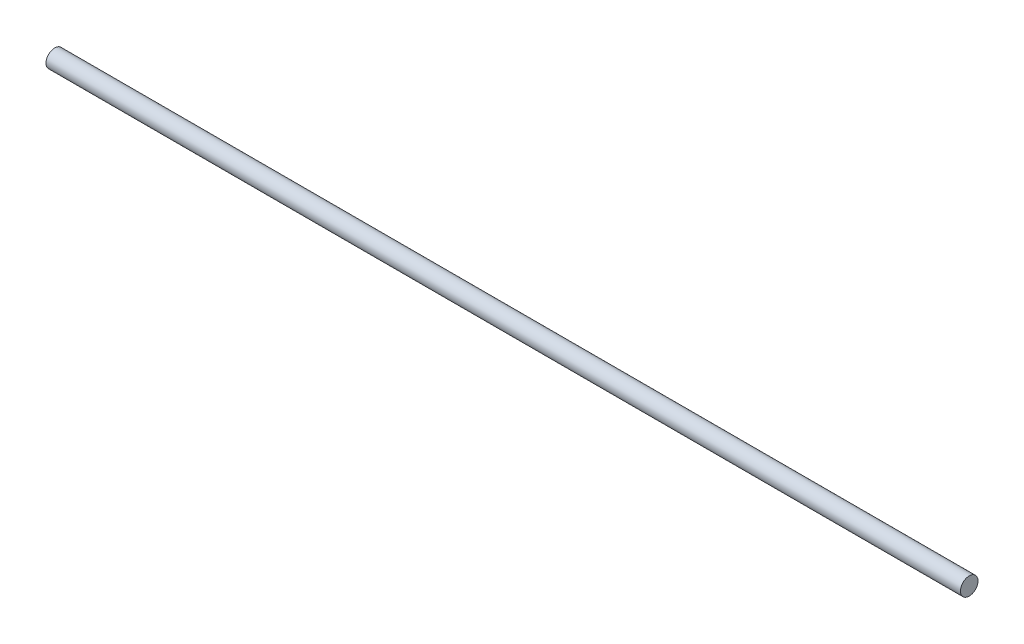
ISO-10303-21;
HEADER;
FILE_DESCRIPTION(('STEP AP214'),'2;1');
FILE_NAME('part.step','',(''),(''),'','','');
FILE_SCHEMA(('AUTOMOTIVE_DESIGN { 1 0 10303 214 1 1 1 1 }'));
ENDSEC;
DATA;
#1=APPLICATION_CONTEXT('core data for automotive mechanical design processes');
#2=APPLICATION_PROTOCOL_DEFINITION('international standard','automotive_design',2000,#1);
#3=PRODUCT_CONTEXT('',#1,'mechanical');
#4=PRODUCT('Part','Part','',(#3));
#5=PRODUCT_RELATED_PRODUCT_CATEGORY('part','',(#4));
#6=PRODUCT_DEFINITION_FORMATION('','',#4);
#7=PRODUCT_DEFINITION_CONTEXT('part definition',#1,'design');
#8=PRODUCT_DEFINITION('design','',#6,#7);
#9=PRODUCT_DEFINITION_SHAPE('','',#8);
#10=(LENGTH_UNIT() NAMED_UNIT(*) SI_UNIT(.MILLI.,.METRE.));
#11=(NAMED_UNIT(*) PLANE_ANGLE_UNIT() SI_UNIT($,.RADIAN.));
#12=(NAMED_UNIT(*) SI_UNIT($,.STERADIAN.) SOLID_ANGLE_UNIT());
#13=UNCERTAINTY_MEASURE_WITH_UNIT(LENGTH_MEASURE(1.E-05),#10,'distance_accuracy_value','');
#14=(GEOMETRIC_REPRESENTATION_CONTEXT(3) GLOBAL_UNCERTAINTY_ASSIGNED_CONTEXT((#13)) GLOBAL_UNIT_ASSIGNED_CONTEXT((#10,
#11,#12)) REPRESENTATION_CONTEXT('',''));
#15=CARTESIAN_POINT('',(0.,0.,0.));
#16=DIRECTION('',(0.,0.,1.));
#17=DIRECTION('',(1.,0.,0.));
#18=AXIS2_PLACEMENT_3D('',#15,#16,#17);
#19=CARTESIAN_POINT('',(416.75,0.,0.));
#20=DIRECTION('',(-1.,0.,0.));
#21=DIRECTION('',(0.,0.,1.));
#22=AXIS2_PLACEMENT_3D('',#19,#20,#21);
#23=CYLINDRICAL_SURFACE('',#22,4.);
#24=CARTESIAN_POINT('',(416.75,0.,0.));
#25=DIRECTION('',(1.,0.,0.));
#26=DIRECTION('',(0.,0.,-1.));
#27=AXIS2_PLACEMENT_3D('',#24,#25,#26);
#28=CIRCLE('',#27,4.);
#29=CARTESIAN_POINT('',(416.75,0.,-4.));
#30=VERTEX_POINT('',#29);
#31=EDGE_CURVE('E10',#30,#30,#28,.T.);
#32=ORIENTED_EDGE('',*,*,#31,.F.);
#33=EDGE_LOOP('',(#32));
#34=FACE_BOUND('',#33,.T.);
#35=CARTESIAN_POINT('',(0.,0.,0.));
#36=DIRECTION('',(1.,0.,0.));
#37=DIRECTION('',(0.,0.,-1.));
#38=AXIS2_PLACEMENT_3D('',#35,#36,#37);
#39=CIRCLE('',#38,4.);
#40=CARTESIAN_POINT('',(0.,0.,-4.));
#41=VERTEX_POINT('',#40);
#42=EDGE_CURVE('E37',#41,#41,#39,.T.);
#43=ORIENTED_EDGE('',*,*,#42,.T.);
#44=EDGE_LOOP('',(#43));
#45=FACE_BOUND('',#44,.T.);
#46=ADVANCED_FACE('F34',(#34,#45),#23,.T.);
#47=CARTESIAN_POINT('',(416.75,0.,0.));
#48=DIRECTION('',(1.,0.,0.));
#49=DIRECTION('',(0.,0.,-1.));
#50=AXIS2_PLACEMENT_3D('',#47,#48,#49);
#51=PLANE('',#50);
#52=ORIENTED_EDGE('',*,*,#31,.T.);
#53=EDGE_LOOP('',(#52));
#54=FACE_BOUND('',#53,.T.);
#55=ADVANCED_FACE('F49',(#54),#51,.T.);
#56=CARTESIAN_POINT('',(0.,0.,0.));
#57=DIRECTION('',(1.,0.,0.));
#58=DIRECTION('',(0.,0.,-1.));
#59=AXIS2_PLACEMENT_3D('',#56,#57,#58);
#60=PLANE('',#59);
#61=ORIENTED_EDGE('',*,*,#42,.F.);
#62=EDGE_LOOP('',(#61));
#63=FACE_BOUND('',#62,.T.);
#64=ADVANCED_FACE('F47',(#63),#60,.F.);
#65=CLOSED_SHELL('',(#46,#55,#64));
#66=MANIFOLD_SOLID_BREP('B2',#65);
#67=ADVANCED_BREP_SHAPE_REPRESENTATION('',(#18,#66),#14);
#68=SHAPE_DEFINITION_REPRESENTATION(#9,#67);
ENDSEC;
END-ISO-10303-21;
